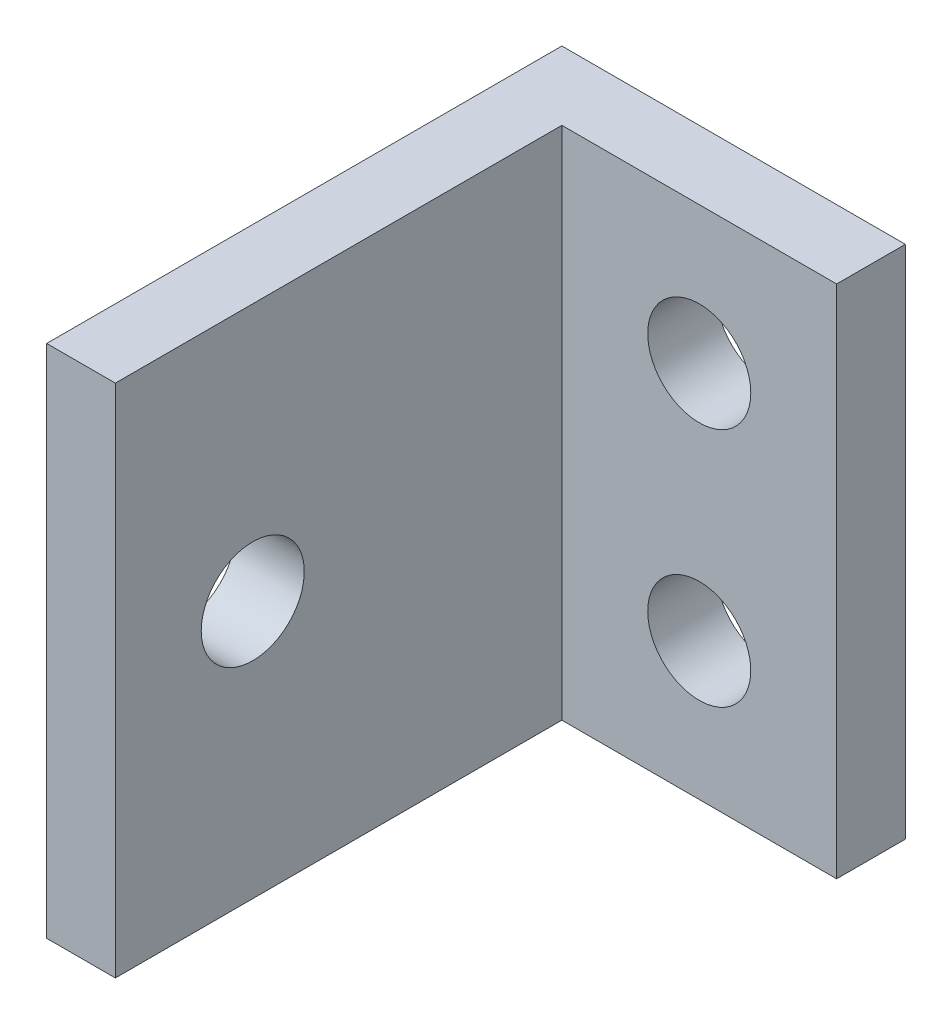
ISO-10303-21;
HEADER;
FILE_DESCRIPTION(('STEP AP214'),'2;1');
FILE_NAME('part.step','',(''),(''),'','','');
FILE_SCHEMA(('AUTOMOTIVE_DESIGN { 1 0 10303 214 1 1 1 1 }'));
ENDSEC;
DATA;
#1=APPLICATION_CONTEXT('core data for automotive mechanical design processes');
#2=APPLICATION_PROTOCOL_DEFINITION('international standard','automotive_design',2000,#1);
#3=PRODUCT_CONTEXT('',#1,'mechanical');
#4=PRODUCT('Part','Part','',(#3));
#5=PRODUCT_RELATED_PRODUCT_CATEGORY('part','',(#4));
#6=PRODUCT_DEFINITION_FORMATION('','',#4);
#7=PRODUCT_DEFINITION_CONTEXT('part definition',#1,'design');
#8=PRODUCT_DEFINITION('design','',#6,#7);
#9=PRODUCT_DEFINITION_SHAPE('','',#8);
#10=(LENGTH_UNIT() NAMED_UNIT(*) SI_UNIT(.MILLI.,.METRE.));
#11=(NAMED_UNIT(*) PLANE_ANGLE_UNIT() SI_UNIT($,.RADIAN.));
#12=(NAMED_UNIT(*) SI_UNIT($,.STERADIAN.) SOLID_ANGLE_UNIT());
#13=UNCERTAINTY_MEASURE_WITH_UNIT(LENGTH_MEASURE(1.E-05),#10,'distance_accuracy_value','');
#14=(GEOMETRIC_REPRESENTATION_CONTEXT(3) GLOBAL_UNCERTAINTY_ASSIGNED_CONTEXT((#13)) GLOBAL_UNIT_ASSIGNED_CONTEXT((#10,
#11,#12)) REPRESENTATION_CONTEXT('',''));
#15=CARTESIAN_POINT('',(0.,0.,0.));
#16=DIRECTION('',(0.,0.,1.));
#17=DIRECTION('',(1.,0.,0.));
#18=AXIS2_PLACEMENT_3D('',#15,#16,#17);
#19=CARTESIAN_POINT('',(4.45631067961165,15.,-12.5970873786408));
#20=DIRECTION('',(0.,0.,1.));
#21=DIRECTION('',(1.,0.,0.));
#22=AXIS2_PLACEMENT_3D('',#19,#20,#21);
#23=PLANE('',#22);
#24=DIRECTION('',(-1.,0.,0.));
#25=VECTOR('',#24,1.);
#26=CARTESIAN_POINT('',(4.45631067961165,0.,-12.5970873786408));
#27=LINE('',#26,#25);
#28=CARTESIAN_POINT('',(4.45631067961165,0.,-12.5970873786408));
#29=VERTEX_POINT('',#28);
#30=CARTESIAN_POINT('',(-5.54368932038835,0.,-12.5970873786408));
#31=VERTEX_POINT('',#30);
#32=EDGE_CURVE('E121',#29,#31,#27,.T.);
#33=ORIENTED_EDGE('',*,*,#32,.T.);
#34=DIRECTION('',(0.,-1.,0.));
#35=VECTOR('',#34,1.);
#36=CARTESIAN_POINT('',(-5.54368932038835,15.,-12.5970873786408));
#37=LINE('',#36,#35);
#38=CARTESIAN_POINT('',(-5.54368932038835,15.,-12.5970873786408));
#39=VERTEX_POINT('',#38);
#40=EDGE_CURVE('E42',#39,#31,#37,.T.);
#41=ORIENTED_EDGE('',*,*,#40,.F.);
#42=DIRECTION('',(-1.,0.,0.));
#43=VECTOR('',#42,1.);
#44=CARTESIAN_POINT('',(4.45631067961165,15.,-12.5970873786408));
#45=LINE('',#44,#43);
#46=CARTESIAN_POINT('',(4.45631067961165,15.,-12.5970873786408));
#47=VERTEX_POINT('',#46);
#48=EDGE_CURVE('E87',#47,#39,#45,.T.);
#49=ORIENTED_EDGE('',*,*,#48,.F.);
#50=DIRECTION('',(0.,-1.,0.));
#51=VECTOR('',#50,1.);
#52=CARTESIAN_POINT('',(4.45631067961165,15.,-12.5970873786408));
#53=LINE('',#52,#51);
#54=EDGE_CURVE('E11',#47,#29,#53,.T.);
#55=ORIENTED_EDGE('',*,*,#54,.T.);
#56=EDGE_LOOP('',(#33,#41,#49,#55));
#57=FACE_BOUND('',#56,.T.);
#58=CARTESIAN_POINT('',(0.456310679611649,4.,-12.5970873786408));
#59=DIRECTION('',(0.,0.,-1.));
#60=DIRECTION('',(-1.,0.,0.));
#61=AXIS2_PLACEMENT_3D('',#58,#59,#60);
#62=CIRCLE('',#61,1.5);
#63=CARTESIAN_POINT('',(-1.04368932038835,4.,-12.5970873786408));
#64=VERTEX_POINT('',#63);
#65=EDGE_CURVE('E158',#64,#64,#62,.T.);
#66=ORIENTED_EDGE('',*,*,#65,.F.);
#67=EDGE_LOOP('',(#66));
#68=FACE_BOUND('',#67,.T.);
#69=CARTESIAN_POINT('',(0.456310679611649,11.,-12.5970873786408));
#70=DIRECTION('',(0.,0.,1.));
#71=DIRECTION('',(1.,0.,0.));
#72=AXIS2_PLACEMENT_3D('',#69,#70,#71);
#73=CIRCLE('',#72,1.5);
#74=CARTESIAN_POINT('',(1.95631067961165,11.,-12.5970873786408));
#75=VERTEX_POINT('',#74);
#76=EDGE_CURVE('E122',#75,#75,#73,.T.);
#77=ORIENTED_EDGE('',*,*,#76,.T.);
#78=EDGE_LOOP('',(#77));
#79=FACE_BOUND('',#78,.T.);
#80=ADVANCED_FACE('F32',(#57,#68,#79),#23,.F.);
#81=CARTESIAN_POINT('',(-3.54368932038835,15.,-10.5970873786408));
#82=DIRECTION('',(0.,0.,-1.));
#83=DIRECTION('',(-1.,0.,0.));
#84=AXIS2_PLACEMENT_3D('',#81,#82,#83);
#85=PLANE('',#84);
#86=DIRECTION('',(1.,0.,0.));
#87=VECTOR('',#86,1.);
#88=CARTESIAN_POINT('',(-3.54368932038835,0.,-10.5970873786408));
#89=LINE('',#88,#87);
#90=CARTESIAN_POINT('',(-3.54368932038835,0.,-10.5970873786408));
#91=VERTEX_POINT('',#90);
#92=CARTESIAN_POINT('',(4.45631067961165,0.,-10.5970873786408));
#93=VERTEX_POINT('',#92);
#94=EDGE_CURVE('E79',#91,#93,#89,.T.);
#95=ORIENTED_EDGE('',*,*,#94,.T.);
#96=DIRECTION('',(0.,-1.,0.));
#97=VECTOR('',#96,1.);
#98=CARTESIAN_POINT('',(4.45631067961165,15.,-10.5970873786408));
#99=LINE('',#98,#97);
#100=CARTESIAN_POINT('',(4.45631067961165,15.,-10.5970873786408));
#101=VERTEX_POINT('',#100);
#102=EDGE_CURVE('E114',#101,#93,#99,.T.);
#103=ORIENTED_EDGE('',*,*,#102,.F.);
#104=DIRECTION('',(1.,0.,0.));
#105=VECTOR('',#104,1.);
#106=CARTESIAN_POINT('',(-3.54368932038835,15.,-10.5970873786408));
#107=LINE('',#106,#105);
#108=CARTESIAN_POINT('',(-3.54368932038835,15.,-10.5970873786408));
#109=VERTEX_POINT('',#108);
#110=EDGE_CURVE('E50',#109,#101,#107,.T.);
#111=ORIENTED_EDGE('',*,*,#110,.F.);
#112=DIRECTION('',(0.,-1.,0.));
#113=VECTOR('',#112,1.);
#114=CARTESIAN_POINT('',(-3.54368932038835,15.,-10.5970873786408));
#115=LINE('',#114,#113);
#116=EDGE_CURVE('E110',#109,#91,#115,.T.);
#117=ORIENTED_EDGE('',*,*,#116,.T.);
#118=EDGE_LOOP('',(#95,#103,#111,#117));
#119=FACE_BOUND('',#118,.T.);
#120=CARTESIAN_POINT('',(0.456310679611649,4.,-10.5970873786408));
#121=DIRECTION('',(0.,0.,-1.));
#122=DIRECTION('',(-1.,0.,0.));
#123=AXIS2_PLACEMENT_3D('',#120,#121,#122);
#124=CIRCLE('',#123,1.5);
#125=CARTESIAN_POINT('',(-1.04368932038835,4.,-10.5970873786408));
#126=VERTEX_POINT('',#125);
#127=EDGE_CURVE('E150',#126,#126,#124,.T.);
#128=ORIENTED_EDGE('',*,*,#127,.T.);
#129=EDGE_LOOP('',(#128));
#130=FACE_BOUND('',#129,.T.);
#131=CARTESIAN_POINT('',(0.456310679611649,11.,-10.5970873786408));
#132=DIRECTION('',(0.,0.,1.));
#133=DIRECTION('',(1.,0.,0.));
#134=AXIS2_PLACEMENT_3D('',#131,#132,#133);
#135=CIRCLE('',#134,1.5);
#136=CARTESIAN_POINT('',(1.95631067961165,11.,-10.5970873786408));
#137=VERTEX_POINT('',#136);
#138=EDGE_CURVE('E153',#137,#137,#135,.T.);
#139=ORIENTED_EDGE('',*,*,#138,.F.);
#140=EDGE_LOOP('',(#139));
#141=FACE_BOUND('',#140,.T.);
#142=ADVANCED_FACE('F143',(#119,#130,#141),#85,.F.);
#143=CARTESIAN_POINT('',(4.45631067961165,15.,-10.5970873786408));
#144=DIRECTION('',(-1.,0.,0.));
#145=DIRECTION('',(0.,0.,1.));
#146=AXIS2_PLACEMENT_3D('',#143,#144,#145);
#147=PLANE('',#146);
#148=DIRECTION('',(0.,0.,-1.));
#149=VECTOR('',#148,1.);
#150=CARTESIAN_POINT('',(4.45631067961165,0.,-10.5970873786408));
#151=LINE('',#150,#149);
#152=EDGE_CURVE('E118',#93,#29,#151,.T.);
#153=ORIENTED_EDGE('',*,*,#152,.T.);
#154=ORIENTED_EDGE('',*,*,#54,.F.);
#155=DIRECTION('',(0.,0.,-1.));
#156=VECTOR('',#155,1.);
#157=CARTESIAN_POINT('',(4.45631067961165,15.,-10.5970873786408));
#158=LINE('',#157,#156);
#159=EDGE_CURVE('E129',#101,#47,#158,.T.);
#160=ORIENTED_EDGE('',*,*,#159,.F.);
#161=ORIENTED_EDGE('',*,*,#102,.T.);
#162=EDGE_LOOP('',(#153,#154,#160,#161));
#163=FACE_BOUND('',#162,.T.);
#164=ADVANCED_FACE('F34',(#163),#147,.F.);
#165=CARTESIAN_POINT('',(-5.54368932038835,15.,-12.5970873786408));
#166=DIRECTION('',(1.,0.,0.));
#167=DIRECTION('',(0.,0.,-1.));
#168=AXIS2_PLACEMENT_3D('',#165,#166,#167);
#169=PLANE('',#168);
#170=CARTESIAN_POINT('',(-5.54368932038835,7.5,-1.59708737864078));
#171=DIRECTION('',(-1.,0.,0.));
#172=DIRECTION('',(0.,0.,1.));
#173=AXIS2_PLACEMENT_3D('',#170,#171,#172);
#174=CIRCLE('',#173,1.5);
#175=CARTESIAN_POINT('',(-5.54368932038835,7.5,-0.0970873786407783));
#176=VERTEX_POINT('',#175);
#177=EDGE_CURVE('E168',#176,#176,#174,.T.);
#178=ORIENTED_EDGE('',*,*,#177,.F.);
#179=EDGE_LOOP('',(#178));
#180=FACE_BOUND('',#179,.T.);
#181=DIRECTION('',(0.,0.,1.));
#182=VECTOR('',#181,1.);
#183=CARTESIAN_POINT('',(-5.54368932038835,0.,-12.5970873786408));
#184=LINE('',#183,#182);
#185=CARTESIAN_POINT('',(-5.54368932038835,0.,2.40291262135922));
#186=VERTEX_POINT('',#185);
#187=EDGE_CURVE('E124',#31,#186,#184,.T.);
#188=ORIENTED_EDGE('',*,*,#187,.T.);
#189=DIRECTION('',(0.,-1.,0.));
#190=VECTOR('',#189,1.);
#191=CARTESIAN_POINT('',(-5.54368932038835,15.,2.40291262135922));
#192=LINE('',#191,#190);
#193=CARTESIAN_POINT('',(-5.54368932038835,15.,2.40291262135922));
#194=VERTEX_POINT('',#193);
#195=EDGE_CURVE('E109',#194,#186,#192,.T.);
#196=ORIENTED_EDGE('',*,*,#195,.F.);
#197=DIRECTION('',(0.,0.,1.));
#198=VECTOR('',#197,1.);
#199=CARTESIAN_POINT('',(-5.54368932038835,15.,-12.5970873786408));
#200=LINE('',#199,#198);
#201=EDGE_CURVE('E100',#39,#194,#200,.T.);
#202=ORIENTED_EDGE('',*,*,#201,.F.);
#203=ORIENTED_EDGE('',*,*,#40,.T.);
#204=EDGE_LOOP('',(#188,#196,#202,#203));
#205=FACE_BOUND('',#204,.T.);
#206=ADVANCED_FACE('F136',(#180,#205),#169,.F.);
#207=CARTESIAN_POINT('',(-5.54368932038835,15.,2.40291262135922));
#208=DIRECTION('',(0.,0.,-1.));
#209=DIRECTION('',(-1.,0.,0.));
#210=AXIS2_PLACEMENT_3D('',#207,#208,#209);
#211=PLANE('',#210);
#212=DIRECTION('',(1.,0.,0.));
#213=VECTOR('',#212,1.);
#214=CARTESIAN_POINT('',(-5.54368932038835,0.,2.40291262135922));
#215=LINE('',#214,#213);
#216=CARTESIAN_POINT('',(-3.54368932038835,0.,2.40291262135922));
#217=VERTEX_POINT('',#216);
#218=EDGE_CURVE('E108',#186,#217,#215,.T.);
#219=ORIENTED_EDGE('',*,*,#218,.T.);
#220=DIRECTION('',(0.,-1.,0.));
#221=VECTOR('',#220,1.);
#222=CARTESIAN_POINT('',(-3.54368932038835,15.,2.40291262135922));
#223=LINE('',#222,#221);
#224=CARTESIAN_POINT('',(-3.54368932038835,15.,2.40291262135922));
#225=VERTEX_POINT('',#224);
#226=EDGE_CURVE('E105',#225,#217,#223,.T.);
#227=ORIENTED_EDGE('',*,*,#226,.F.);
#228=DIRECTION('',(1.,0.,0.));
#229=VECTOR('',#228,1.);
#230=CARTESIAN_POINT('',(-5.54368932038835,15.,2.40291262135922));
#231=LINE('',#230,#229);
#232=EDGE_CURVE('E94',#194,#225,#231,.T.);
#233=ORIENTED_EDGE('',*,*,#232,.F.);
#234=ORIENTED_EDGE('',*,*,#195,.T.);
#235=EDGE_LOOP('',(#219,#227,#233,#234));
#236=FACE_BOUND('',#235,.T.);
#237=ADVANCED_FACE('F106',(#236),#211,.F.);
#238=CARTESIAN_POINT('',(-3.54368932038835,15.,2.40291262135922));
#239=DIRECTION('',(-1.,0.,0.));
#240=DIRECTION('',(0.,0.,1.));
#241=AXIS2_PLACEMENT_3D('',#238,#239,#240);
#242=PLANE('',#241);
#243=CARTESIAN_POINT('',(-3.54368932038835,7.5,-1.59708737864078));
#244=DIRECTION('',(-1.,0.,0.));
#245=DIRECTION('',(0.,0.,1.));
#246=AXIS2_PLACEMENT_3D('',#243,#244,#245);
#247=CIRCLE('',#246,1.5);
#248=CARTESIAN_POINT('',(-3.54368932038835,7.5,-0.0970873786407785));
#249=VERTEX_POINT('',#248);
#250=EDGE_CURVE('E36',#249,#249,#247,.T.);
#251=ORIENTED_EDGE('',*,*,#250,.T.);
#252=EDGE_LOOP('',(#251));
#253=FACE_BOUND('',#252,.T.);
#254=DIRECTION('',(0.,0.,-1.));
#255=VECTOR('',#254,1.);
#256=CARTESIAN_POINT('',(-3.54368932038835,0.,2.40291262135922));
#257=LINE('',#256,#255);
#258=EDGE_CURVE('E73',#217,#91,#257,.T.);
#259=ORIENTED_EDGE('',*,*,#258,.T.);
#260=ORIENTED_EDGE('',*,*,#116,.F.);
#261=DIRECTION('',(0.,0.,-1.));
#262=VECTOR('',#261,1.);
#263=CARTESIAN_POINT('',(-3.54368932038835,15.,2.40291262135922));
#264=LINE('',#263,#262);
#265=EDGE_CURVE('E98',#225,#109,#264,.T.);
#266=ORIENTED_EDGE('',*,*,#265,.F.);
#267=ORIENTED_EDGE('',*,*,#226,.T.);
#268=EDGE_LOOP('',(#259,#260,#266,#267));
#269=FACE_BOUND('',#268,.T.);
#270=ADVANCED_FACE('F112',(#253,#269),#242,.F.);
#271=CARTESIAN_POINT('',(0.,15.,0.));
#272=DIRECTION('',(0.,1.,0.));
#273=DIRECTION('',(0.,0.,1.));
#274=AXIS2_PLACEMENT_3D('',#271,#272,#273);
#275=PLANE('',#274);
#276=ORIENTED_EDGE('',*,*,#159,.T.);
#277=ORIENTED_EDGE('',*,*,#48,.T.);
#278=ORIENTED_EDGE('',*,*,#201,.T.);
#279=ORIENTED_EDGE('',*,*,#232,.T.);
#280=ORIENTED_EDGE('',*,*,#265,.T.);
#281=ORIENTED_EDGE('',*,*,#110,.T.);
#282=EDGE_LOOP('',(#276,#277,#278,#279,#280,#281));
#283=FACE_BOUND('',#282,.T.);
#284=ADVANCED_FACE('F96',(#283),#275,.T.);
#285=CARTESIAN_POINT('',(0.,0.,0.));
#286=DIRECTION('',(0.,1.,0.));
#287=DIRECTION('',(0.,0.,1.));
#288=AXIS2_PLACEMENT_3D('',#285,#286,#287);
#289=PLANE('',#288);
#290=ORIENTED_EDGE('',*,*,#152,.F.);
#291=ORIENTED_EDGE('',*,*,#94,.F.);
#292=ORIENTED_EDGE('',*,*,#258,.F.);
#293=ORIENTED_EDGE('',*,*,#218,.F.);
#294=ORIENTED_EDGE('',*,*,#187,.F.);
#295=ORIENTED_EDGE('',*,*,#32,.F.);
#296=EDGE_LOOP('',(#290,#291,#292,#293,#294,#295));
#297=FACE_BOUND('',#296,.T.);
#298=ADVANCED_FACE('F139',(#297),#289,.F.);
#299=CARTESIAN_POINT('',(0.456310679611649,4.,-12.5970873786408));
#300=DIRECTION('',(0.,0.,1.));
#301=DIRECTION('',(1.,0.,0.));
#302=AXIS2_PLACEMENT_3D('',#299,#300,#301);
#303=CYLINDRICAL_SURFACE('',#302,1.5);
#304=ORIENTED_EDGE('',*,*,#65,.T.);
#305=EDGE_LOOP('',(#304));
#306=FACE_BOUND('',#305,.T.);
#307=ORIENTED_EDGE('',*,*,#127,.F.);
#308=EDGE_LOOP('',(#307));
#309=FACE_BOUND('',#308,.T.);
#310=ADVANCED_FACE('F193',(#306,#309),#303,.F.);
#311=CARTESIAN_POINT('',(0.456310679611649,11.,-12.5970873786408));
#312=DIRECTION('',(0.,0.,1.));
#313=DIRECTION('',(1.,0.,0.));
#314=AXIS2_PLACEMENT_3D('',#311,#312,#313);
#315=CYLINDRICAL_SURFACE('',#314,1.5);
#316=ORIENTED_EDGE('',*,*,#76,.F.);
#317=EDGE_LOOP('',(#316));
#318=FACE_BOUND('',#317,.T.);
#319=ORIENTED_EDGE('',*,*,#138,.T.);
#320=EDGE_LOOP('',(#319));
#321=FACE_BOUND('',#320,.T.);
#322=ADVANCED_FACE('F191',(#318,#321),#315,.F.);
#323=CARTESIAN_POINT('',(4.45631067961165,7.5,-1.59708737864078));
#324=DIRECTION('',(-1.,0.,0.));
#325=DIRECTION('',(0.,0.,1.));
#326=AXIS2_PLACEMENT_3D('',#323,#324,#325);
#327=CYLINDRICAL_SURFACE('',#326,1.5);
#328=ORIENTED_EDGE('',*,*,#177,.T.);
#329=EDGE_LOOP('',(#328));
#330=FACE_BOUND('',#329,.T.);
#331=ORIENTED_EDGE('',*,*,#250,.F.);
#332=EDGE_LOOP('',(#331));
#333=FACE_BOUND('',#332,.T.);
#334=ADVANCED_FACE('F174',(#330,#333),#327,.F.);
#335=CLOSED_SHELL('',(#80,#142,#164,#206,#237,#270,#284,#298,#310,#322,#334));
#336=MANIFOLD_SOLID_BREP('B2',#335);
#337=ADVANCED_BREP_SHAPE_REPRESENTATION('',(#18,#336),#14);
#338=SHAPE_DEFINITION_REPRESENTATION(#9,#337);
ENDSEC;
END-ISO-10303-21;
